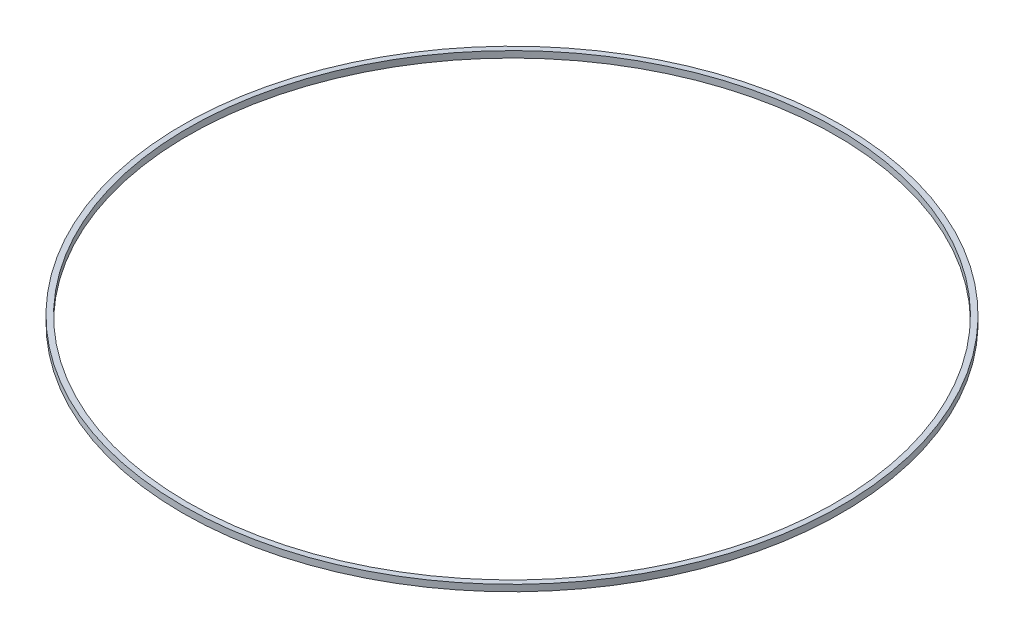
ISO-10303-21;
HEADER;
FILE_DESCRIPTION(('STEP AP214'),'2;1');
FILE_NAME('part.step','',(''),(''),'','','');
FILE_SCHEMA(('AUTOMOTIVE_DESIGN { 1 0 10303 214 1 1 1 1 }'));
ENDSEC;
DATA;
#1=APPLICATION_CONTEXT('core data for automotive mechanical design processes');
#2=APPLICATION_PROTOCOL_DEFINITION('international standard','automotive_design',2000,#1);
#3=PRODUCT_CONTEXT('',#1,'mechanical');
#4=PRODUCT('Part','Part','',(#3));
#5=PRODUCT_RELATED_PRODUCT_CATEGORY('part','',(#4));
#6=PRODUCT_DEFINITION_FORMATION('','',#4);
#7=PRODUCT_DEFINITION_CONTEXT('part definition',#1,'design');
#8=PRODUCT_DEFINITION('design','',#6,#7);
#9=PRODUCT_DEFINITION_SHAPE('','',#8);
#10=(LENGTH_UNIT() NAMED_UNIT(*) SI_UNIT(.MILLI.,.METRE.));
#11=(NAMED_UNIT(*) PLANE_ANGLE_UNIT() SI_UNIT($,.RADIAN.));
#12=(NAMED_UNIT(*) SI_UNIT($,.STERADIAN.) SOLID_ANGLE_UNIT());
#13=UNCERTAINTY_MEASURE_WITH_UNIT(LENGTH_MEASURE(1.E-05),#10,'distance_accuracy_value','');
#14=(GEOMETRIC_REPRESENTATION_CONTEXT(3) GLOBAL_UNCERTAINTY_ASSIGNED_CONTEXT((#13)) GLOBAL_UNIT_ASSIGNED_CONTEXT((#10,
#11,#12)) REPRESENTATION_CONTEXT('',''));
#15=CARTESIAN_POINT('',(0.,0.,0.));
#16=DIRECTION('',(0.,0.,1.));
#17=DIRECTION('',(1.,0.,0.));
#18=AXIS2_PLACEMENT_3D('',#15,#16,#17);
#19=CARTESIAN_POINT('',(0.,3.,0.));
#20=DIRECTION('',(0.,1.,0.));
#21=DIRECTION('',(0.,0.,1.));
#22=AXIS2_PLACEMENT_3D('',#19,#20,#21);
#23=PLANE('',#22);
#24=CARTESIAN_POINT('',(0.,3.,0.));
#25=DIRECTION('',(0.,1.,0.));
#26=DIRECTION('',(0.,0.,1.));
#27=AXIS2_PLACEMENT_3D('',#24,#25,#26);
#28=CIRCLE('',#27,153.);
#29=CARTESIAN_POINT('',(0.,3.,153.));
#30=VERTEX_POINT('',#29);
#31=EDGE_CURVE('E10',#30,#30,#28,.T.);
#32=ORIENTED_EDGE('',*,*,#31,.T.);
#33=EDGE_LOOP('',(#32));
#34=FACE_BOUND('',#33,.T.);
#35=CARTESIAN_POINT('',(0.,3.,0.));
#36=DIRECTION('',(0.,1.,0.));
#37=DIRECTION('',(0.,0.,1.));
#38=AXIS2_PLACEMENT_3D('',#35,#36,#37);
#39=CIRCLE('',#38,150.5);
#40=CARTESIAN_POINT('',(0.,3.,150.5));
#41=VERTEX_POINT('',#40);
#42=EDGE_CURVE('E56',#41,#41,#39,.T.);
#43=ORIENTED_EDGE('',*,*,#42,.F.);
#44=EDGE_LOOP('',(#43));
#45=FACE_BOUND('',#44,.T.);
#46=ADVANCED_FACE('F43',(#34,#45),#23,.T.);
#47=CARTESIAN_POINT('',(0.,0.,0.));
#48=DIRECTION('',(0.,1.,0.));
#49=DIRECTION('',(0.,0.,1.));
#50=AXIS2_PLACEMENT_3D('',#47,#48,#49);
#51=PLANE('',#50);
#52=CARTESIAN_POINT('',(0.,0.,0.));
#53=DIRECTION('',(0.,1.,0.));
#54=DIRECTION('',(0.,0.,1.));
#55=AXIS2_PLACEMENT_3D('',#52,#53,#54);
#56=CIRCLE('',#55,153.);
#57=CARTESIAN_POINT('',(0.,0.,153.));
#58=VERTEX_POINT('',#57);
#59=EDGE_CURVE('E47',#58,#58,#56,.T.);
#60=ORIENTED_EDGE('',*,*,#59,.F.);
#61=EDGE_LOOP('',(#60));
#62=FACE_BOUND('',#61,.T.);
#63=CARTESIAN_POINT('',(0.,0.,0.));
#64=DIRECTION('',(0.,1.,0.));
#65=DIRECTION('',(0.,0.,1.));
#66=AXIS2_PLACEMENT_3D('',#63,#64,#65);
#67=CIRCLE('',#66,150.5);
#68=CARTESIAN_POINT('',(0.,0.,150.5));
#69=VERTEX_POINT('',#68);
#70=EDGE_CURVE('E58',#69,#69,#67,.T.);
#71=ORIENTED_EDGE('',*,*,#70,.T.);
#72=EDGE_LOOP('',(#71));
#73=FACE_BOUND('',#72,.T.);
#74=ADVANCED_FACE('F70',(#62,#73),#51,.F.);
#75=CARTESIAN_POINT('',(0.,3.,0.));
#76=DIRECTION('',(0.,-1.,0.));
#77=DIRECTION('',(0.,0.,-1.));
#78=AXIS2_PLACEMENT_3D('',#75,#76,#77);
#79=CYLINDRICAL_SURFACE('',#78,153.);
#80=ORIENTED_EDGE('',*,*,#31,.F.);
#81=EDGE_LOOP('',(#80));
#82=FACE_BOUND('',#81,.T.);
#83=ORIENTED_EDGE('',*,*,#59,.T.);
#84=EDGE_LOOP('',(#83));
#85=FACE_BOUND('',#84,.T.);
#86=ADVANCED_FACE('F45',(#82,#85),#79,.T.);
#87=CARTESIAN_POINT('',(0.,3.,0.));
#88=DIRECTION('',(0.,-1.,0.));
#89=DIRECTION('',(0.,0.,-1.));
#90=AXIS2_PLACEMENT_3D('',#87,#88,#89);
#91=CYLINDRICAL_SURFACE('',#90,150.5);
#92=ORIENTED_EDGE('',*,*,#42,.T.);
#93=EDGE_LOOP('',(#92));
#94=FACE_BOUND('',#93,.T.);
#95=ORIENTED_EDGE('',*,*,#70,.F.);
#96=EDGE_LOOP('',(#95));
#97=FACE_BOUND('',#96,.T.);
#98=ADVANCED_FACE('F66',(#94,#97),#91,.F.);
#99=CLOSED_SHELL('',(#46,#74,#86,#98));
#100=MANIFOLD_SOLID_BREP('B2',#99);
#101=ADVANCED_BREP_SHAPE_REPRESENTATION('',(#18,#100),#14);
#102=SHAPE_DEFINITION_REPRESENTATION(#9,#101);
ENDSEC;
END-ISO-10303-21;
